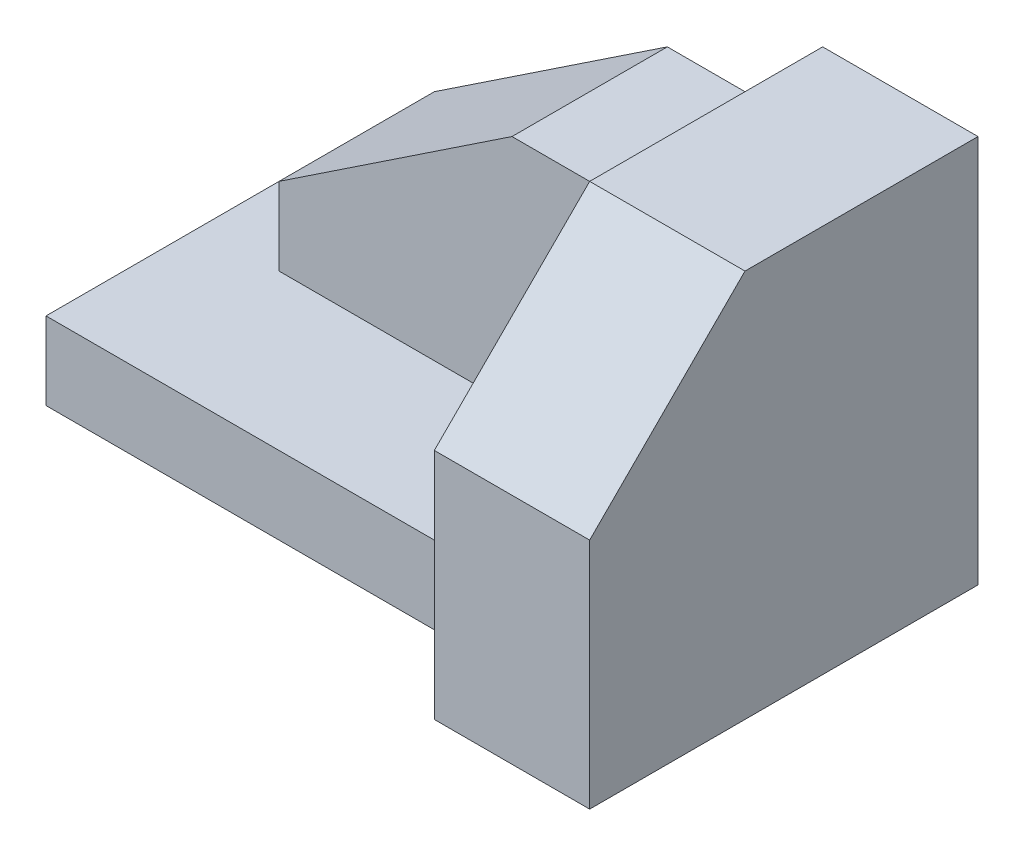
ISO-10303-21;
HEADER;
FILE_DESCRIPTION(('STEP AP214'),'2;1');
FILE_NAME('part.step','',(''),(''),'','','');
FILE_SCHEMA(('AUTOMOTIVE_DESIGN { 1 0 10303 214 1 1 1 1 }'));
ENDSEC;
DATA;
#1=APPLICATION_CONTEXT('core data for automotive mechanical design processes');
#2=APPLICATION_PROTOCOL_DEFINITION('international standard','automotive_design',2000,#1);
#3=PRODUCT_CONTEXT('',#1,'mechanical');
#4=PRODUCT('Part','Part','',(#3));
#5=PRODUCT_RELATED_PRODUCT_CATEGORY('part','',(#4));
#6=PRODUCT_DEFINITION_FORMATION('','',#4);
#7=PRODUCT_DEFINITION_CONTEXT('part definition',#1,'design');
#8=PRODUCT_DEFINITION('design','',#6,#7);
#9=PRODUCT_DEFINITION_SHAPE('','',#8);
#10=(LENGTH_UNIT() NAMED_UNIT(*) SI_UNIT(.MILLI.,.METRE.));
#11=(NAMED_UNIT(*) PLANE_ANGLE_UNIT() SI_UNIT($,.RADIAN.));
#12=(NAMED_UNIT(*) SI_UNIT($,.STERADIAN.) SOLID_ANGLE_UNIT());
#13=UNCERTAINTY_MEASURE_WITH_UNIT(LENGTH_MEASURE(1.E-05),#10,'distance_accuracy_value','');
#14=(GEOMETRIC_REPRESENTATION_CONTEXT(3) GLOBAL_UNCERTAINTY_ASSIGNED_CONTEXT((#13)) GLOBAL_UNIT_ASSIGNED_CONTEXT((#10,
#11,#12)) REPRESENTATION_CONTEXT('',''));
#15=CARTESIAN_POINT('',(0.,0.,0.));
#16=DIRECTION('',(0.,0.,1.));
#17=DIRECTION('',(1.,0.,0.));
#18=AXIS2_PLACEMENT_3D('',#15,#16,#17);
#19=CARTESIAN_POINT('',(60.,10.,0.));
#20=DIRECTION('',(1.,0.,0.));
#21=DIRECTION('',(0.,0.,-1.));
#22=AXIS2_PLACEMENT_3D('',#19,#20,#21);
#23=PLANE('',#22);
#24=DIRECTION('',(0.,-1.,0.));
#25=VECTOR('',#24,1.);
#26=CARTESIAN_POINT('',(60.,40.,-30.));
#27=LINE('',#26,#25);
#28=CARTESIAN_POINT('',(60.,40.,-30.));
#29=VERTEX_POINT('',#28);
#30=CARTESIAN_POINT('',(60.,10.,-30.));
#31=VERTEX_POINT('',#30);
#32=EDGE_CURVE('E138',#29,#31,#27,.T.);
#33=ORIENTED_EDGE('',*,*,#32,.T.);
#34=DIRECTION('',(0.,0.,1.));
#35=VECTOR('',#34,1.);
#36=CARTESIAN_POINT('',(60.,10.,-50.));
#37=LINE('',#36,#35);
#38=CARTESIAN_POINT('',(60.,10.,-10.));
#39=VERTEX_POINT('',#38);
#40=EDGE_CURVE('E152',#31,#39,#37,.T.);
#41=ORIENTED_EDGE('',*,*,#40,.T.);
#42=DIRECTION('',(0.,-1.,0.));
#43=VECTOR('',#42,1.);
#44=CARTESIAN_POINT('',(60.,10.,-10.));
#45=LINE('',#44,#43);
#46=CARTESIAN_POINT('',(60.,0.,-10.));
#47=VERTEX_POINT('',#46);
#48=EDGE_CURVE('E168',#39,#47,#45,.T.);
#49=ORIENTED_EDGE('',*,*,#48,.T.);
#50=DIRECTION('',(0.,0.,1.));
#51=VECTOR('',#50,1.);
#52=CARTESIAN_POINT('',(60.,0.,0.));
#53=LINE('',#52,#51);
#54=CARTESIAN_POINT('',(60.,0.,0.));
#55=VERTEX_POINT('',#54);
#56=EDGE_CURVE('E209',#47,#55,#53,.T.);
#57=ORIENTED_EDGE('',*,*,#56,.T.);
#58=DIRECTION('',(0.,-1.,0.));
#59=VECTOR('',#58,1.);
#60=CARTESIAN_POINT('',(60.,10.,0.));
#61=LINE('',#60,#59);
#62=CARTESIAN_POINT('',(60.,30.,0.));
#63=VERTEX_POINT('',#62);
#64=EDGE_CURVE('E178',#63,#55,#61,.T.);
#65=ORIENTED_EDGE('',*,*,#64,.F.);
#66=DIRECTION('',(0.,0.707106781186548,-0.707106781186548));
#67=VECTOR('',#66,1.);
#68=CARTESIAN_POINT('',(60.,20.,10.));
#69=LINE('',#68,#67);
#70=CARTESIAN_POINT('',(60.,50.,-20.));
#71=VERTEX_POINT('',#70);
#72=EDGE_CURVE('E149',#63,#71,#69,.T.);
#73=ORIENTED_EDGE('',*,*,#72,.T.);
#74=DIRECTION('',(0.,0.,1.));
#75=VECTOR('',#74,1.);
#76=CARTESIAN_POINT('',(60.,50.,-50.));
#77=LINE('',#76,#75);
#78=CARTESIAN_POINT('',(60.,50.,-50.));
#79=VERTEX_POINT('',#78);
#80=EDGE_CURVE('E157',#79,#71,#77,.T.);
#81=ORIENTED_EDGE('',*,*,#80,.F.);
#82=DIRECTION('',(0.,-1.,0.));
#83=VECTOR('',#82,1.);
#84=CARTESIAN_POINT('',(60.,50.,-50.));
#85=LINE('',#84,#83);
#86=CARTESIAN_POINT('',(60.,40.,-50.));
#87=VERTEX_POINT('',#86);
#88=EDGE_CURVE('E160',#79,#87,#85,.T.);
#89=ORIENTED_EDGE('',*,*,#88,.T.);
#90=DIRECTION('',(0.,0.,-1.));
#91=VECTOR('',#90,1.);
#92=CARTESIAN_POINT('',(60.,40.,-50.));
#93=LINE('',#92,#91);
#94=EDGE_CURVE('E239',#29,#87,#93,.T.);
#95=ORIENTED_EDGE('',*,*,#94,.F.);
#96=EDGE_LOOP('',(#33,#41,#49,#57,#65,#73,#81,#89,#95));
#97=FACE_BOUND('',#96,.T.);
#98=ADVANCED_FACE('F35',(#97),#23,.F.);
#99=CARTESIAN_POINT('',(0.,10.,0.));
#100=DIRECTION('',(0.,1.,0.));
#101=DIRECTION('',(0.,0.,1.));
#102=AXIS2_PLACEMENT_3D('',#99,#100,#101);
#103=PLANE('',#102);
#104=DIRECTION('',(1.,0.,0.));
#105=VECTOR('',#104,1.);
#106=CARTESIAN_POINT('',(60.,10.,-30.));
#107=LINE('',#106,#105);
#108=CARTESIAN_POINT('',(10.,10.,-30.));
#109=VERTEX_POINT('',#108);
#110=EDGE_CURVE('E238',#109,#31,#107,.T.);
#111=ORIENTED_EDGE('',*,*,#110,.F.);
#112=DIRECTION('',(0.,0.,1.));
#113=VECTOR('',#112,1.);
#114=CARTESIAN_POINT('',(9.99999999999999,10.,-50.));
#115=LINE('',#114,#113);
#116=CARTESIAN_POINT('',(9.99999999999999,10.,-50.));
#117=VERTEX_POINT('',#116);
#118=EDGE_CURVE('E135',#117,#109,#115,.T.);
#119=ORIENTED_EDGE('',*,*,#118,.F.);
#120=DIRECTION('',(1.,0.,0.));
#121=VECTOR('',#120,1.);
#122=CARTESIAN_POINT('',(0.,10.,-50.));
#123=LINE('',#122,#121);
#124=CARTESIAN_POINT('',(0.,10.,-50.));
#125=VERTEX_POINT('',#124);
#126=EDGE_CURVE('E184',#125,#117,#123,.T.);
#127=ORIENTED_EDGE('',*,*,#126,.F.);
#128=DIRECTION('',(0.,0.,-1.));
#129=VECTOR('',#128,1.);
#130=CARTESIAN_POINT('',(0.,10.,0.));
#131=LINE('',#130,#129);
#132=CARTESIAN_POINT('',(0.,10.,-10.));
#133=VERTEX_POINT('',#132);
#134=EDGE_CURVE('E188',#133,#125,#131,.T.);
#135=ORIENTED_EDGE('',*,*,#134,.F.);
#136=DIRECTION('',(1.,0.,0.));
#137=VECTOR('',#136,1.);
#138=CARTESIAN_POINT('',(0.,10.,-10.));
#139=LINE('',#138,#137);
#140=EDGE_CURVE('E181',#133,#39,#139,.T.);
#141=ORIENTED_EDGE('',*,*,#140,.T.);
#142=ORIENTED_EDGE('',*,*,#40,.F.);
#143=EDGE_LOOP('',(#111,#119,#127,#135,#141,#142));
#144=FACE_BOUND('',#143,.T.);
#145=ADVANCED_FACE('F222',(#144),#103,.T.);
#146=CARTESIAN_POINT('',(0.,10.,-10.));
#147=DIRECTION('',(0.,0.,-1.));
#148=DIRECTION('',(-1.,0.,0.));
#149=AXIS2_PLACEMENT_3D('',#146,#147,#148);
#150=PLANE('',#149);
#151=DIRECTION('',(1.,0.,0.));
#152=VECTOR('',#151,1.);
#153=CARTESIAN_POINT('',(0.,0.,-10.));
#154=LINE('',#153,#152);
#155=CARTESIAN_POINT('',(0.,0.,-10.));
#156=VERTEX_POINT('',#155);
#157=EDGE_CURVE('E173',#156,#47,#154,.T.);
#158=ORIENTED_EDGE('',*,*,#157,.T.);
#159=ORIENTED_EDGE('',*,*,#48,.F.);
#160=ORIENTED_EDGE('',*,*,#140,.F.);
#161=DIRECTION('',(0.,-1.,0.));
#162=VECTOR('',#161,1.);
#163=CARTESIAN_POINT('',(0.,10.,-10.));
#164=LINE('',#163,#162);
#165=EDGE_CURVE('E196',#133,#156,#164,.T.);
#166=ORIENTED_EDGE('',*,*,#165,.T.);
#167=EDGE_LOOP('',(#158,#159,#160,#166));
#168=FACE_BOUND('',#167,.T.);
#169=ADVANCED_FACE('F37',(#168),#150,.F.);
#170=CARTESIAN_POINT('',(0.,10.,0.));
#171=DIRECTION('',(0.,0.,-1.));
#172=DIRECTION('',(-1.,0.,0.));
#173=AXIS2_PLACEMENT_3D('',#170,#171,#172);
#174=PLANE('',#173);
#175=DIRECTION('',(0.,-1.,0.));
#176=VECTOR('',#175,1.);
#177=CARTESIAN_POINT('',(80.,10.,0.));
#178=LINE('',#177,#176);
#179=CARTESIAN_POINT('',(80.,30.,0.));
#180=VERTEX_POINT('',#179);
#181=CARTESIAN_POINT('',(80.,0.,0.));
#182=VERTEX_POINT('',#181);
#183=EDGE_CURVE('E190',#180,#182,#178,.T.);
#184=ORIENTED_EDGE('',*,*,#183,.F.);
#185=DIRECTION('',(1.,0.,0.));
#186=VECTOR('',#185,1.);
#187=CARTESIAN_POINT('',(40.,30.,0.));
#188=LINE('',#187,#186);
#189=EDGE_CURVE('E147',#63,#180,#188,.T.);
#190=ORIENTED_EDGE('',*,*,#189,.F.);
#191=ORIENTED_EDGE('',*,*,#64,.T.);
#192=DIRECTION('',(1.,0.,0.));
#193=VECTOR('',#192,1.);
#194=CARTESIAN_POINT('',(0.,0.,0.));
#195=LINE('',#194,#193);
#196=EDGE_CURVE('E206',#55,#182,#195,.T.);
#197=ORIENTED_EDGE('',*,*,#196,.T.);
#198=EDGE_LOOP('',(#184,#190,#191,#197));
#199=FACE_BOUND('',#198,.T.);
#200=ADVANCED_FACE('F260',(#199),#174,.F.);
#201=CARTESIAN_POINT('',(80.,10.,0.));
#202=DIRECTION('',(-1.,0.,0.));
#203=DIRECTION('',(0.,0.,1.));
#204=AXIS2_PLACEMENT_3D('',#201,#202,#203);
#205=PLANE('',#204);
#206=DIRECTION('',(0.,0.,-1.));
#207=VECTOR('',#206,1.);
#208=CARTESIAN_POINT('',(80.,50.,-50.));
#209=LINE('',#208,#207);
#210=CARTESIAN_POINT('',(80.,50.,-20.));
#211=VERTEX_POINT('',#210);
#212=CARTESIAN_POINT('',(80.,50.,-50.));
#213=VERTEX_POINT('',#212);
#214=EDGE_CURVE('E153',#211,#213,#209,.T.);
#215=ORIENTED_EDGE('',*,*,#214,.F.);
#216=DIRECTION('',(0.,0.707106781186548,-0.707106781186548));
#217=VECTOR('',#216,1.);
#218=CARTESIAN_POINT('',(80.,50.,-20.));
#219=LINE('',#218,#217);
#220=EDGE_CURVE('E140',#180,#211,#219,.T.);
#221=ORIENTED_EDGE('',*,*,#220,.F.);
#222=ORIENTED_EDGE('',*,*,#183,.T.);
#223=DIRECTION('',(0.,0.,-1.));
#224=VECTOR('',#223,1.);
#225=CARTESIAN_POINT('',(80.,0.,0.));
#226=LINE('',#225,#224);
#227=CARTESIAN_POINT('',(80.,0.,-50.));
#228=VERTEX_POINT('',#227);
#229=EDGE_CURVE('E203',#182,#228,#226,.T.);
#230=ORIENTED_EDGE('',*,*,#229,.T.);
#231=DIRECTION('',(0.,-1.,0.));
#232=VECTOR('',#231,1.);
#233=CARTESIAN_POINT('',(80.,10.,-50.));
#234=LINE('',#233,#232);
#235=EDGE_CURVE('E192',#213,#228,#234,.T.);
#236=ORIENTED_EDGE('',*,*,#235,.F.);
#237=EDGE_LOOP('',(#215,#221,#222,#230,#236));
#238=FACE_BOUND('',#237,.T.);
#239=ADVANCED_FACE('F257',(#238),#205,.F.);
#240=CARTESIAN_POINT('',(0.,10.,-50.));
#241=DIRECTION('',(0.,0.,-1.));
#242=DIRECTION('',(-1.,0.,0.));
#243=AXIS2_PLACEMENT_3D('',#240,#241,#242);
#244=PLANE('',#243);
#245=DIRECTION('',(-0.832050294337844,-0.554700196225229,0.));
#246=VECTOR('',#245,1.);
#247=CARTESIAN_POINT('',(-1.53846153846154,12.3076923076923,-50.));
#248=LINE('',#247,#246);
#249=CARTESIAN_POINT('',(40.,40.,-50.));
#250=VERTEX_POINT('',#249);
#251=CARTESIAN_POINT('',(10.,20.,-50.));
#252=VERTEX_POINT('',#251);
#253=EDGE_CURVE('E124',#250,#252,#248,.T.);
#254=ORIENTED_EDGE('',*,*,#253,.F.);
#255=DIRECTION('',(-1.,0.,0.));
#256=VECTOR('',#255,1.);
#257=CARTESIAN_POINT('',(60.,40.,-50.));
#258=LINE('',#257,#256);
#259=EDGE_CURVE('E241',#87,#250,#258,.T.);
#260=ORIENTED_EDGE('',*,*,#259,.F.);
#261=ORIENTED_EDGE('',*,*,#88,.F.);
#262=DIRECTION('',(-1.,0.,0.));
#263=VECTOR('',#262,1.);
#264=CARTESIAN_POINT('',(80.,50.,-50.));
#265=LINE('',#264,#263);
#266=EDGE_CURVE('E155',#213,#79,#265,.T.);
#267=ORIENTED_EDGE('',*,*,#266,.F.);
#268=ORIENTED_EDGE('',*,*,#235,.T.);
#269=DIRECTION('',(1.,0.,0.));
#270=VECTOR('',#269,1.);
#271=CARTESIAN_POINT('',(0.,0.,-50.));
#272=LINE('',#271,#270);
#273=CARTESIAN_POINT('',(0.,0.,-50.));
#274=VERTEX_POINT('',#273);
#275=EDGE_CURVE('E200',#274,#228,#272,.T.);
#276=ORIENTED_EDGE('',*,*,#275,.F.);
#277=DIRECTION('',(0.,-1.,0.));
#278=VECTOR('',#277,1.);
#279=CARTESIAN_POINT('',(0.,10.,-50.));
#280=LINE('',#279,#278);
#281=EDGE_CURVE('E194',#125,#274,#280,.T.);
#282=ORIENTED_EDGE('',*,*,#281,.F.);
#283=ORIENTED_EDGE('',*,*,#126,.T.);
#284=DIRECTION('',(0.,-1.,0.));
#285=VECTOR('',#284,1.);
#286=CARTESIAN_POINT('',(9.99999999999999,40.,-50.));
#287=LINE('',#286,#285);
#288=EDGE_CURVE('E137',#252,#117,#287,.T.);
#289=ORIENTED_EDGE('',*,*,#288,.F.);
#290=EDGE_LOOP('',(#254,#260,#261,#267,#268,#276,#282,#283,#289));
#291=FACE_BOUND('',#290,.T.);
#292=ADVANCED_FACE('F226',(#291),#244,.T.);
#293=CARTESIAN_POINT('',(0.,10.,0.));
#294=DIRECTION('',(-1.,0.,0.));
#295=DIRECTION('',(0.,0.,1.));
#296=AXIS2_PLACEMENT_3D('',#293,#294,#295);
#297=PLANE('',#296);
#298=DIRECTION('',(0.,0.,-1.));
#299=VECTOR('',#298,1.);
#300=CARTESIAN_POINT('',(0.,0.,0.));
#301=LINE('',#300,#299);
#302=EDGE_CURVE('E185',#156,#274,#301,.T.);
#303=ORIENTED_EDGE('',*,*,#302,.F.);
#304=ORIENTED_EDGE('',*,*,#165,.F.);
#305=ORIENTED_EDGE('',*,*,#134,.T.);
#306=ORIENTED_EDGE('',*,*,#281,.T.);
#307=EDGE_LOOP('',(#303,#304,#305,#306));
#308=FACE_BOUND('',#307,.T.);
#309=ADVANCED_FACE('F217',(#308),#297,.T.);
#310=CARTESIAN_POINT('',(0.,0.,0.));
#311=DIRECTION('',(0.,1.,0.));
#312=DIRECTION('',(0.,0.,1.));
#313=AXIS2_PLACEMENT_3D('',#310,#311,#312);
#314=PLANE('',#313);
#315=ORIENTED_EDGE('',*,*,#157,.F.);
#316=ORIENTED_EDGE('',*,*,#302,.T.);
#317=ORIENTED_EDGE('',*,*,#275,.T.);
#318=ORIENTED_EDGE('',*,*,#229,.F.);
#319=ORIENTED_EDGE('',*,*,#196,.F.);
#320=ORIENTED_EDGE('',*,*,#56,.F.);
#321=EDGE_LOOP('',(#315,#316,#317,#318,#319,#320));
#322=FACE_BOUND('',#321,.T.);
#323=ADVANCED_FACE('F232',(#322),#314,.F.);
#324=CARTESIAN_POINT('',(0.,50.,0.));
#325=DIRECTION('',(0.,-1.,0.));
#326=DIRECTION('',(0.,0.,-1.));
#327=AXIS2_PLACEMENT_3D('',#324,#325,#326);
#328=PLANE('',#327);
#329=ORIENTED_EDGE('',*,*,#80,.T.);
#330=DIRECTION('',(1.,0.,0.));
#331=VECTOR('',#330,1.);
#332=CARTESIAN_POINT('',(0.,50.,-20.));
#333=LINE('',#332,#331);
#334=EDGE_CURVE('E43',#71,#211,#333,.T.);
#335=ORIENTED_EDGE('',*,*,#334,.T.);
#336=ORIENTED_EDGE('',*,*,#214,.T.);
#337=ORIENTED_EDGE('',*,*,#266,.T.);
#338=EDGE_LOOP('',(#329,#335,#336,#337));
#339=FACE_BOUND('',#338,.T.);
#340=ADVANCED_FACE('F253',(#339),#328,.F.);
#341=CARTESIAN_POINT('',(40.,50.,-20.));
#342=DIRECTION('',(0.,-0.707106781186548,-0.707106781186548));
#343=DIRECTION('',(0.,0.707106781186548,-0.707106781186548));
#344=AXIS2_PLACEMENT_3D('',#341,#342,#343);
#345=PLANE('',#344);
#346=ORIENTED_EDGE('',*,*,#189,.T.);
#347=ORIENTED_EDGE('',*,*,#220,.T.);
#348=ORIENTED_EDGE('',*,*,#334,.F.);
#349=ORIENTED_EDGE('',*,*,#72,.F.);
#350=EDGE_LOOP('',(#346,#347,#348,#349));
#351=FACE_BOUND('',#350,.T.);
#352=ADVANCED_FACE('F263',(#351),#345,.F.);
#353=CARTESIAN_POINT('',(9.99999999999999,40.,-50.));
#354=DIRECTION('',(1.,0.,0.));
#355=DIRECTION('',(0.,0.,-1.));
#356=AXIS2_PLACEMENT_3D('',#353,#354,#355);
#357=PLANE('',#356);
#358=DIRECTION('',(0.,-1.,0.));
#359=VECTOR('',#358,1.);
#360=CARTESIAN_POINT('',(10.,40.,-30.));
#361=LINE('',#360,#359);
#362=CARTESIAN_POINT('',(10.,20.,-30.));
#363=VERTEX_POINT('',#362);
#364=EDGE_CURVE('E56',#363,#109,#361,.T.);
#365=ORIENTED_EDGE('',*,*,#364,.F.);
#366=DIRECTION('',(0.,0.,1.));
#367=VECTOR('',#366,1.);
#368=CARTESIAN_POINT('',(10.,20.,-60.));
#369=LINE('',#368,#367);
#370=EDGE_CURVE('E121',#252,#363,#369,.T.);
#371=ORIENTED_EDGE('',*,*,#370,.F.);
#372=ORIENTED_EDGE('',*,*,#288,.T.);
#373=ORIENTED_EDGE('',*,*,#118,.T.);
#374=EDGE_LOOP('',(#365,#371,#372,#373));
#375=FACE_BOUND('',#374,.T.);
#376=ADVANCED_FACE('F133',(#375),#357,.F.);
#377=CARTESIAN_POINT('',(60.,40.,-30.));
#378=DIRECTION('',(0.,0.,-1.));
#379=DIRECTION('',(-1.,0.,0.));
#380=AXIS2_PLACEMENT_3D('',#377,#378,#379);
#381=PLANE('',#380);
#382=DIRECTION('',(1.,0.,0.));
#383=VECTOR('',#382,1.);
#384=CARTESIAN_POINT('',(60.,40.,-30.));
#385=LINE('',#384,#383);
#386=CARTESIAN_POINT('',(40.,40.,-30.));
#387=VERTEX_POINT('',#386);
#388=EDGE_CURVE('E131',#387,#29,#385,.T.);
#389=ORIENTED_EDGE('',*,*,#388,.F.);
#390=DIRECTION('',(0.832050294337844,0.554700196225229,0.));
#391=VECTOR('',#390,1.);
#392=CARTESIAN_POINT('',(40.,40.,-30.));
#393=LINE('',#392,#391);
#394=EDGE_CURVE('E50',#363,#387,#393,.T.);
#395=ORIENTED_EDGE('',*,*,#394,.F.);
#396=ORIENTED_EDGE('',*,*,#364,.T.);
#397=ORIENTED_EDGE('',*,*,#110,.T.);
#398=ORIENTED_EDGE('',*,*,#32,.F.);
#399=EDGE_LOOP('',(#389,#395,#396,#397,#398));
#400=FACE_BOUND('',#399,.T.);
#401=ADVANCED_FACE('F129',(#400),#381,.F.);
#402=CARTESIAN_POINT('',(0.,40.,0.));
#403=DIRECTION('',(0.,-1.,0.));
#404=DIRECTION('',(0.,0.,-1.));
#405=AXIS2_PLACEMENT_3D('',#402,#403,#404);
#406=PLANE('',#405);
#407=ORIENTED_EDGE('',*,*,#259,.T.);
#408=DIRECTION('',(0.,0.,1.));
#409=VECTOR('',#408,1.);
#410=CARTESIAN_POINT('',(40.,40.,0.));
#411=LINE('',#410,#409);
#412=EDGE_CURVE('E11',#250,#387,#411,.T.);
#413=ORIENTED_EDGE('',*,*,#412,.T.);
#414=ORIENTED_EDGE('',*,*,#388,.T.);
#415=ORIENTED_EDGE('',*,*,#94,.T.);
#416=EDGE_LOOP('',(#407,#413,#414,#415));
#417=FACE_BOUND('',#416,.T.);
#418=ADVANCED_FACE('F249',(#417),#406,.F.);
#419=CARTESIAN_POINT('',(40.,40.,-60.));
#420=DIRECTION('',(0.554700196225229,-0.832050294337844,0.));
#421=DIRECTION('',(0.832050294337844,0.554700196225229,0.));
#422=AXIS2_PLACEMENT_3D('',#419,#420,#421);
#423=PLANE('',#422);
#424=ORIENTED_EDGE('',*,*,#253,.T.);
#425=ORIENTED_EDGE('',*,*,#370,.T.);
#426=ORIENTED_EDGE('',*,*,#394,.T.);
#427=ORIENTED_EDGE('',*,*,#412,.F.);
#428=EDGE_LOOP('',(#424,#425,#426,#427));
#429=FACE_BOUND('',#428,.T.);
#430=ADVANCED_FACE('F122',(#429),#423,.F.);
#431=CLOSED_SHELL('',(#98,#145,#169,#200,#239,#292,#309,#323,#340,#352,#376,#401,#418,#430));
#432=MANIFOLD_SOLID_BREP('B2',#431);
#433=ADVANCED_BREP_SHAPE_REPRESENTATION('',(#18,#432),#14);
#434=SHAPE_DEFINITION_REPRESENTATION(#9,#433);
ENDSEC;
END-ISO-10303-21;
